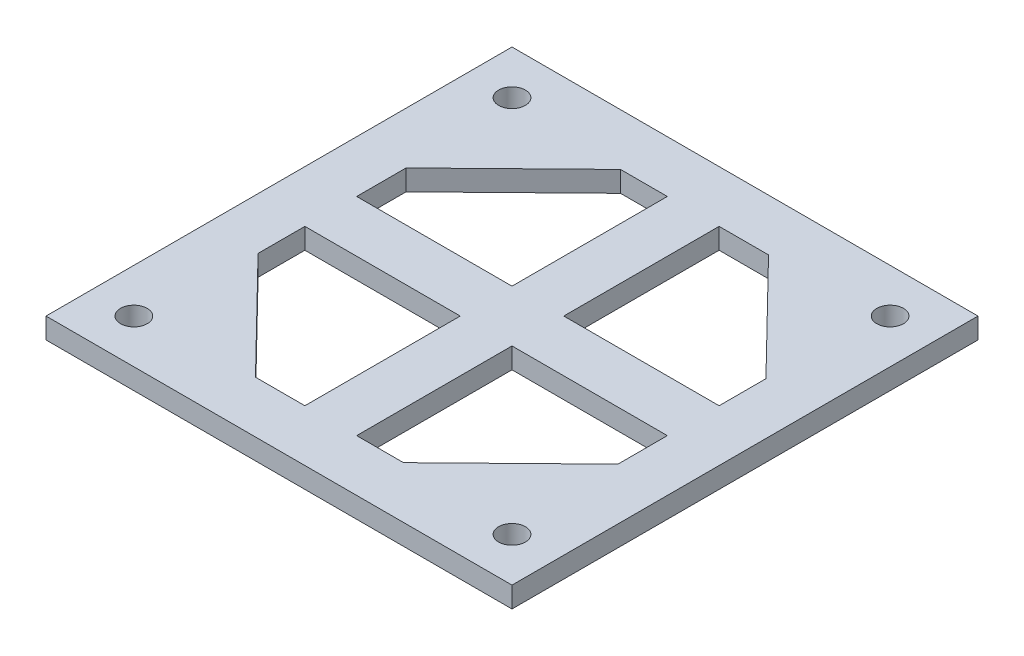
ISO-10303-21;
HEADER;
FILE_DESCRIPTION(('STEP AP214'),'2;1');
FILE_NAME('part.step','',(''),(''),'','','');
FILE_SCHEMA(('AUTOMOTIVE_DESIGN { 1 0 10303 214 1 1 1 1 }'));
ENDSEC;
DATA;
#1=APPLICATION_CONTEXT('core data for automotive mechanical design processes');
#2=APPLICATION_PROTOCOL_DEFINITION('international standard','automotive_design',2000,#1);
#3=PRODUCT_CONTEXT('',#1,'mechanical');
#4=PRODUCT('Part','Part','',(#3));
#5=PRODUCT_RELATED_PRODUCT_CATEGORY('part','',(#4));
#6=PRODUCT_DEFINITION_FORMATION('','',#4);
#7=PRODUCT_DEFINITION_CONTEXT('part definition',#1,'design');
#8=PRODUCT_DEFINITION('design','',#6,#7);
#9=PRODUCT_DEFINITION_SHAPE('','',#8);
#10=(LENGTH_UNIT() NAMED_UNIT(*) SI_UNIT(.MILLI.,.METRE.));
#11=(NAMED_UNIT(*) PLANE_ANGLE_UNIT() SI_UNIT($,.RADIAN.));
#12=(NAMED_UNIT(*) SI_UNIT($,.STERADIAN.) SOLID_ANGLE_UNIT());
#13=UNCERTAINTY_MEASURE_WITH_UNIT(LENGTH_MEASURE(1.E-05),#10,'distance_accuracy_value','');
#14=(GEOMETRIC_REPRESENTATION_CONTEXT(3) GLOBAL_UNCERTAINTY_ASSIGNED_CONTEXT((#13)) GLOBAL_UNIT_ASSIGNED_CONTEXT((#10,
#11,#12)) REPRESENTATION_CONTEXT('',''));
#15=CARTESIAN_POINT('',(0.,0.,0.));
#16=DIRECTION('',(0.,0.,1.));
#17=DIRECTION('',(1.,0.,0.));
#18=AXIS2_PLACEMENT_3D('',#15,#16,#17);
#19=CARTESIAN_POINT('',(22.5,2.,-22.5));
#20=DIRECTION('',(-1.,0.,0.));
#21=DIRECTION('',(0.,0.,1.));
#22=AXIS2_PLACEMENT_3D('',#19,#20,#21);
#23=PLANE('',#22);
#24=DIRECTION('',(0.,0.,-1.));
#25=VECTOR('',#24,1.);
#26=CARTESIAN_POINT('',(22.5,0.,-22.5));
#27=LINE('',#26,#25);
#28=CARTESIAN_POINT('',(22.5,0.,22.5));
#29=VERTEX_POINT('',#28);
#30=CARTESIAN_POINT('',(22.5,0.,-22.5));
#31=VERTEX_POINT('',#30);
#32=EDGE_CURVE('E367',#29,#31,#27,.T.);
#33=ORIENTED_EDGE('',*,*,#32,.T.);
#34=DIRECTION('',(0.,-1.,0.));
#35=VECTOR('',#34,1.);
#36=CARTESIAN_POINT('',(22.5,2.,-22.5));
#37=LINE('',#36,#35);
#38=CARTESIAN_POINT('',(22.5,2.,-22.5));
#39=VERTEX_POINT('',#38);
#40=EDGE_CURVE('E11',#39,#31,#37,.T.);
#41=ORIENTED_EDGE('',*,*,#40,.F.);
#42=DIRECTION('',(0.,0.,-1.));
#43=VECTOR('',#42,1.);
#44=CARTESIAN_POINT('',(22.5,2.,-22.5));
#45=LINE('',#44,#43);
#46=CARTESIAN_POINT('',(22.5,2.,22.5));
#47=VERTEX_POINT('',#46);
#48=EDGE_CURVE('E368',#47,#39,#45,.T.);
#49=ORIENTED_EDGE('',*,*,#48,.F.);
#50=DIRECTION('',(0.,-1.,0.));
#51=VECTOR('',#50,1.);
#52=CARTESIAN_POINT('',(22.5,2.,22.5));
#53=LINE('',#52,#51);
#54=EDGE_CURVE('E378',#47,#29,#53,.T.);
#55=ORIENTED_EDGE('',*,*,#54,.T.);
#56=EDGE_LOOP('',(#33,#41,#49,#55));
#57=FACE_BOUND('',#56,.T.);
#58=ADVANCED_FACE('F39',(#57),#23,.F.);
#59=CARTESIAN_POINT('',(-22.5,2.,-22.5));
#60=DIRECTION('',(0.,0.,1.));
#61=DIRECTION('',(1.,0.,0.));
#62=AXIS2_PLACEMENT_3D('',#59,#60,#61);
#63=PLANE('',#62);
#64=DIRECTION('',(-1.,0.,0.));
#65=VECTOR('',#64,1.);
#66=CARTESIAN_POINT('',(-22.5,0.,-22.5));
#67=LINE('',#66,#65);
#68=CARTESIAN_POINT('',(-22.5,0.,-22.5));
#69=VERTEX_POINT('',#68);
#70=EDGE_CURVE('E381',#31,#69,#67,.T.);
#71=ORIENTED_EDGE('',*,*,#70,.T.);
#72=DIRECTION('',(0.,-1.,0.));
#73=VECTOR('',#72,1.);
#74=CARTESIAN_POINT('',(-22.5,2.,-22.5));
#75=LINE('',#74,#73);
#76=CARTESIAN_POINT('',(-22.5,2.,-22.5));
#77=VERTEX_POINT('',#76);
#78=EDGE_CURVE('E46',#77,#69,#75,.T.);
#79=ORIENTED_EDGE('',*,*,#78,.F.);
#80=DIRECTION('',(-1.,0.,0.));
#81=VECTOR('',#80,1.);
#82=CARTESIAN_POINT('',(-22.5,2.,-22.5));
#83=LINE('',#82,#81);
#84=EDGE_CURVE('E371',#39,#77,#83,.T.);
#85=ORIENTED_EDGE('',*,*,#84,.F.);
#86=ORIENTED_EDGE('',*,*,#40,.T.);
#87=EDGE_LOOP('',(#71,#79,#85,#86));
#88=FACE_BOUND('',#87,.T.);
#89=ADVANCED_FACE('F410',(#88),#63,.F.);
#90=CARTESIAN_POINT('',(-22.5,2.,-22.5));
#91=DIRECTION('',(1.,0.,0.));
#92=DIRECTION('',(0.,0.,-1.));
#93=AXIS2_PLACEMENT_3D('',#90,#91,#92);
#94=PLANE('',#93);
#95=DIRECTION('',(0.,0.,1.));
#96=VECTOR('',#95,1.);
#97=CARTESIAN_POINT('',(-22.5,0.,-22.5));
#98=LINE('',#97,#96);
#99=CARTESIAN_POINT('',(-22.5,0.,22.5));
#100=VERTEX_POINT('',#99);
#101=EDGE_CURVE('E383',#69,#100,#98,.T.);
#102=ORIENTED_EDGE('',*,*,#101,.T.);
#103=DIRECTION('',(0.,-1.,0.));
#104=VECTOR('',#103,1.);
#105=CARTESIAN_POINT('',(-22.5,2.,22.5));
#106=LINE('',#105,#104);
#107=CARTESIAN_POINT('',(-22.5,2.,22.5));
#108=VERTEX_POINT('',#107);
#109=EDGE_CURVE('E388',#108,#100,#106,.T.);
#110=ORIENTED_EDGE('',*,*,#109,.F.);
#111=DIRECTION('',(0.,0.,1.));
#112=VECTOR('',#111,1.);
#113=CARTESIAN_POINT('',(-22.5,2.,-22.5));
#114=LINE('',#113,#112);
#115=EDGE_CURVE('E374',#77,#108,#114,.T.);
#116=ORIENTED_EDGE('',*,*,#115,.F.);
#117=ORIENTED_EDGE('',*,*,#78,.T.);
#118=EDGE_LOOP('',(#102,#110,#116,#117));
#119=FACE_BOUND('',#118,.T.);
#120=ADVANCED_FACE('F395',(#119),#94,.F.);
#121=CARTESIAN_POINT('',(-22.5,2.,22.5));
#122=DIRECTION('',(0.,0.,-1.));
#123=DIRECTION('',(-1.,0.,0.));
#124=AXIS2_PLACEMENT_3D('',#121,#122,#123);
#125=PLANE('',#124);
#126=DIRECTION('',(1.,0.,0.));
#127=VECTOR('',#126,1.);
#128=CARTESIAN_POINT('',(-22.5,0.,22.5));
#129=LINE('',#128,#127);
#130=EDGE_CURVE('E372',#100,#29,#129,.T.);
#131=ORIENTED_EDGE('',*,*,#130,.T.);
#132=ORIENTED_EDGE('',*,*,#54,.F.);
#133=DIRECTION('',(1.,0.,0.));
#134=VECTOR('',#133,1.);
#135=CARTESIAN_POINT('',(-22.5,2.,22.5));
#136=LINE('',#135,#134);
#137=EDGE_CURVE('E376',#108,#47,#136,.T.);
#138=ORIENTED_EDGE('',*,*,#137,.F.);
#139=ORIENTED_EDGE('',*,*,#109,.T.);
#140=EDGE_LOOP('',(#131,#132,#138,#139));
#141=FACE_BOUND('',#140,.T.);
#142=ADVANCED_FACE('F404',(#141),#125,.F.);
#143=CARTESIAN_POINT('',(0.,2.,0.));
#144=DIRECTION('',(0.,1.,0.));
#145=DIRECTION('',(0.,0.,1.));
#146=AXIS2_PLACEMENT_3D('',#143,#144,#145);
#147=PLANE('',#146);
#148=CARTESIAN_POINT('',(-18.2573593128807,2.,-18.2573593128807));
#149=DIRECTION('',(0.,1.,0.));
#150=DIRECTION('',(0.,0.,1.));
#151=AXIS2_PLACEMENT_3D('',#148,#149,#150);
#152=CIRCLE('',#151,1.28921475598744);
#153=CARTESIAN_POINT('',(-18.2573593128807,2.,-16.9681445568933));
#154=VERTEX_POINT('',#153);
#155=EDGE_CURVE('E520',#154,#154,#152,.F.);
#156=ORIENTED_EDGE('',*,*,#155,.T.);
#157=EDGE_LOOP('',(#156));
#158=FACE_BOUND('',#157,.T.);
#159=CARTESIAN_POINT('',(18.2573593128809,2.,-18.2573593128805));
#160=DIRECTION('',(0.,1.,0.));
#161=DIRECTION('',(0.,0.,1.));
#162=AXIS2_PLACEMENT_3D('',#159,#160,#161);
#163=CIRCLE('',#162,1.28921475598744);
#164=CARTESIAN_POINT('',(18.2573593128809,2.,-16.9681445568931));
#165=VERTEX_POINT('',#164);
#166=EDGE_CURVE('E533',#165,#165,#163,.F.);
#167=ORIENTED_EDGE('',*,*,#166,.T.);
#168=EDGE_LOOP('',(#167));
#169=FACE_BOUND('',#168,.T.);
#170=CARTESIAN_POINT('',(-18.2573593128808,2.,18.2573593128807));
#171=DIRECTION('',(0.,1.,0.));
#172=DIRECTION('',(0.,0.,1.));
#173=AXIS2_PLACEMENT_3D('',#170,#171,#172);
#174=CIRCLE('',#173,1.28921475598744);
#175=CARTESIAN_POINT('',(-18.2573593128808,2.,19.5465740688681));
#176=VERTEX_POINT('',#175);
#177=EDGE_CURVE('E524',#176,#176,#174,.F.);
#178=ORIENTED_EDGE('',*,*,#177,.T.);
#179=EDGE_LOOP('',(#178));
#180=FACE_BOUND('',#179,.T.);
#181=DIRECTION('',(0.,0.,1.));
#182=VECTOR('',#181,1.);
#183=CARTESIAN_POINT('',(-2.5,2.,-2.5));
#184=LINE('',#183,#182);
#185=CARTESIAN_POINT('',(-2.5,2.,-17.5));
#186=VERTEX_POINT('',#185);
#187=CARTESIAN_POINT('',(-2.5,2.,-2.5));
#188=VERTEX_POINT('',#187);
#189=EDGE_CURVE('E212',#186,#188,#184,.T.);
#190=ORIENTED_EDGE('',*,*,#189,.T.);
#191=DIRECTION('',(-1.,0.,0.));
#192=VECTOR('',#191,1.);
#193=CARTESIAN_POINT('',(-17.5,2.,-2.5));
#194=LINE('',#193,#192);
#195=CARTESIAN_POINT('',(-17.5,2.,-2.5));
#196=VERTEX_POINT('',#195);
#197=EDGE_CURVE('E199',#188,#196,#194,.T.);
#198=ORIENTED_EDGE('',*,*,#197,.T.);
#199=DIRECTION('',(0.,0.,-1.));
#200=VECTOR('',#199,1.);
#201=CARTESIAN_POINT('',(-17.5,2.,-7.27171556224812));
#202=LINE('',#201,#200);
#203=CARTESIAN_POINT('',(-17.5,2.,-7.27171556224812));
#204=VERTEX_POINT('',#203);
#205=EDGE_CURVE('E235',#196,#204,#202,.T.);
#206=ORIENTED_EDGE('',*,*,#205,.T.);
#207=DIRECTION('',(0.715587384960187,0.,-0.698523224013233));
#208=VECTOR('',#207,1.);
#209=CARTESIAN_POINT('',(-7.02184972263544,2.,-17.5));
#210=LINE('',#209,#208);
#211=CARTESIAN_POINT('',(-7.02184972263544,2.,-17.5));
#212=VERTEX_POINT('',#211);
#213=EDGE_CURVE('E232',#204,#212,#210,.T.);
#214=ORIENTED_EDGE('',*,*,#213,.T.);
#215=DIRECTION('',(1.,0.,0.));
#216=VECTOR('',#215,1.);
#217=CARTESIAN_POINT('',(-2.5,2.,-17.5));
#218=LINE('',#217,#216);
#219=EDGE_CURVE('E221',#212,#186,#218,.T.);
#220=ORIENTED_EDGE('',*,*,#219,.T.);
#221=EDGE_LOOP('',(#190,#198,#206,#214,#220));
#222=FACE_BOUND('',#221,.T.);
#223=DIRECTION('',(-1.,0.,0.));
#224=VECTOR('',#223,1.);
#225=CARTESIAN_POINT('',(2.50000000000002,2.,-2.49999999999997));
#226=LINE('',#225,#224);
#227=CARTESIAN_POINT('',(17.5,2.,-2.49999999999982));
#228=VERTEX_POINT('',#227);
#229=CARTESIAN_POINT('',(2.50000000000002,2.,-2.49999999999997));
#230=VERTEX_POINT('',#229);
#231=EDGE_CURVE('E245',#228,#230,#226,.T.);
#232=ORIENTED_EDGE('',*,*,#231,.T.);
#233=DIRECTION('',(0.,0.,-1.));
#234=VECTOR('',#233,1.);
#235=CARTESIAN_POINT('',(2.50000000000018,2.,-17.5));
#236=LINE('',#235,#234);
#237=CARTESIAN_POINT('',(2.50000000000018,2.,-17.5));
#238=VERTEX_POINT('',#237);
#239=EDGE_CURVE('E273',#230,#238,#236,.T.);
#240=ORIENTED_EDGE('',*,*,#239,.T.);
#241=DIRECTION('',(1.,0.,0.));
#242=VECTOR('',#241,1.);
#243=CARTESIAN_POINT('',(7.27171556224831,2.,-17.4999999999999));
#244=LINE('',#243,#242);
#245=CARTESIAN_POINT('',(7.27171556224831,2.,-17.4999999999999));
#246=VERTEX_POINT('',#245);
#247=EDGE_CURVE('E269',#238,#246,#244,.T.);
#248=ORIENTED_EDGE('',*,*,#247,.T.);
#249=DIRECTION('',(0.698523224013226,0.,0.715587384960194));
#250=VECTOR('',#249,1.);
#251=CARTESIAN_POINT('',(17.5000000000001,2.,-7.02184972263526));
#252=LINE('',#251,#250);
#253=CARTESIAN_POINT('',(17.5000000000001,2.,-7.02184972263526));
#254=VERTEX_POINT('',#253);
#255=EDGE_CURVE('E265',#246,#254,#252,.T.);
#256=ORIENTED_EDGE('',*,*,#255,.T.);
#257=DIRECTION('',(0.,0.,1.));
#258=VECTOR('',#257,1.);
#259=CARTESIAN_POINT('',(17.5,2.,-2.49999999999982));
#260=LINE('',#259,#258);
#261=EDGE_CURVE('E261',#254,#228,#260,.T.);
#262=ORIENTED_EDGE('',*,*,#261,.T.);
#263=EDGE_LOOP('',(#232,#240,#248,#256,#262));
#264=FACE_BOUND('',#263,.T.);
#265=DIRECTION('',(1.,0.,0.));
#266=VECTOR('',#265,1.);
#267=CARTESIAN_POINT('',(-2.50000000000001,2.,2.49999999999999));
#268=LINE('',#267,#266);
#269=CARTESIAN_POINT('',(-17.5,2.,2.49999999999994));
#270=VERTEX_POINT('',#269);
#271=CARTESIAN_POINT('',(-2.50000000000001,2.00000000000001,2.49999999999999));
#272=VERTEX_POINT('',#271);
#273=EDGE_CURVE('E284',#270,#272,#268,.T.);
#274=ORIENTED_EDGE('',*,*,#273,.T.);
#275=DIRECTION('',(0.,0.,1.));
#276=VECTOR('',#275,1.);
#277=CARTESIAN_POINT('',(-2.50000000000006,2.,17.5));
#278=LINE('',#277,#276);
#279=CARTESIAN_POINT('',(-2.50000000000006,2.,17.5));
#280=VERTEX_POINT('',#279);
#281=EDGE_CURVE('E312',#272,#280,#278,.T.);
#282=ORIENTED_EDGE('',*,*,#281,.T.);
#283=DIRECTION('',(-1.,0.,0.));
#284=VECTOR('',#283,1.);
#285=CARTESIAN_POINT('',(-7.27171556224818,2.,17.5));
#286=LINE('',#285,#284);
#287=CARTESIAN_POINT('',(-7.27171556224818,2.,17.5));
#288=VERTEX_POINT('',#287);
#289=EDGE_CURVE('E308',#280,#288,#286,.T.);
#290=ORIENTED_EDGE('',*,*,#289,.T.);
#291=DIRECTION('',(-0.698523224013231,0.,-0.715587384960189));
#292=VECTOR('',#291,1.);
#293=CARTESIAN_POINT('',(-17.5,2.,7.02184972263538));
#294=LINE('',#293,#292);
#295=CARTESIAN_POINT('',(-17.5,2.,7.02184972263538));
#296=VERTEX_POINT('',#295);
#297=EDGE_CURVE('E304',#288,#296,#294,.T.);
#298=ORIENTED_EDGE('',*,*,#297,.T.);
#299=DIRECTION('',(0.,0.,-1.));
#300=VECTOR('',#299,1.);
#301=CARTESIAN_POINT('',(-17.5,2.,2.49999999999994));
#302=LINE('',#301,#300);
#303=EDGE_CURVE('E299',#296,#270,#302,.T.);
#304=ORIENTED_EDGE('',*,*,#303,.T.);
#305=EDGE_LOOP('',(#274,#282,#290,#298,#304));
#306=FACE_BOUND('',#305,.T.);
#307=CARTESIAN_POINT('',(18.2573593128807,2.,18.2573593128807));
#308=DIRECTION('',(0.,1.,0.));
#309=DIRECTION('',(0.,0.,1.));
#310=AXIS2_PLACEMENT_3D('',#307,#308,#309);
#311=CIRCLE('',#310,1.28921475598744);
#312=CARTESIAN_POINT('',(18.2573593128807,2.,19.5465740688682));
#313=VERTEX_POINT('',#312);
#314=EDGE_CURVE('E321',#313,#313,#311,.F.);
#315=ORIENTED_EDGE('',*,*,#314,.T.);
#316=EDGE_LOOP('',(#315));
#317=FACE_BOUND('',#316,.T.);
#318=DIRECTION('',(0.,0.,-1.));
#319=VECTOR('',#318,1.);
#320=CARTESIAN_POINT('',(2.5,2.,2.5));
#321=LINE('',#320,#319);
#322=CARTESIAN_POINT('',(2.5,2.,17.5));
#323=VERTEX_POINT('',#322);
#324=CARTESIAN_POINT('',(2.5,2.,2.5));
#325=VERTEX_POINT('',#324);
#326=EDGE_CURVE('E330',#323,#325,#321,.T.);
#327=ORIENTED_EDGE('',*,*,#326,.T.);
#328=DIRECTION('',(1.,0.,0.));
#329=VECTOR('',#328,1.);
#330=CARTESIAN_POINT('',(17.5,2.,2.5));
#331=LINE('',#330,#329);
#332=CARTESIAN_POINT('',(17.5,2.,2.5));
#333=VERTEX_POINT('',#332);
#334=EDGE_CURVE('E358',#325,#333,#331,.T.);
#335=ORIENTED_EDGE('',*,*,#334,.T.);
#336=DIRECTION('',(0.,0.,1.));
#337=VECTOR('',#336,1.);
#338=CARTESIAN_POINT('',(17.5,2.,7.27171556224812));
#339=LINE('',#338,#337);
#340=CARTESIAN_POINT('',(17.5,2.,7.27171556224812));
#341=VERTEX_POINT('',#340);
#342=EDGE_CURVE('E354',#333,#341,#339,.T.);
#343=ORIENTED_EDGE('',*,*,#342,.T.);
#344=DIRECTION('',(-0.715587384960187,0.,0.698523224013233));
#345=VECTOR('',#344,1.);
#346=CARTESIAN_POINT('',(7.02184972263544,2.,17.5));
#347=LINE('',#346,#345);
#348=CARTESIAN_POINT('',(7.02184972263544,2.,17.5));
#349=VERTEX_POINT('',#348);
#350=EDGE_CURVE('E350',#341,#349,#347,.T.);
#351=ORIENTED_EDGE('',*,*,#350,.T.);
#352=DIRECTION('',(-1.,0.,0.));
#353=VECTOR('',#352,1.);
#354=CARTESIAN_POINT('',(2.5,2.,17.5));
#355=LINE('',#354,#353);
#356=EDGE_CURVE('E345',#349,#323,#355,.T.);
#357=ORIENTED_EDGE('',*,*,#356,.T.);
#358=EDGE_LOOP('',(#327,#335,#343,#351,#357));
#359=FACE_BOUND('',#358,.T.);
#360=ORIENTED_EDGE('',*,*,#48,.T.);
#361=ORIENTED_EDGE('',*,*,#84,.T.);
#362=ORIENTED_EDGE('',*,*,#115,.T.);
#363=ORIENTED_EDGE('',*,*,#137,.T.);
#364=EDGE_LOOP('',(#360,#361,#362,#363));
#365=FACE_BOUND('',#364,.T.);
#366=ADVANCED_FACE('F218',(#158,#169,#180,#222,#264,#306,#317,#359,#365),#147,.T.);
#367=CARTESIAN_POINT('',(0.,0.,0.));
#368=DIRECTION('',(0.,1.,0.));
#369=DIRECTION('',(0.,0.,1.));
#370=AXIS2_PLACEMENT_3D('',#367,#368,#369);
#371=PLANE('',#370);
#372=CARTESIAN_POINT('',(-18.2573593128807,0.,-18.2573593128807));
#373=DIRECTION('',(0.,-1.,0.));
#374=DIRECTION('',(0.,0.,1.));
#375=AXIS2_PLACEMENT_3D('',#372,#373,#374);
#376=CIRCLE('',#375,1.28921475598744);
#377=CARTESIAN_POINT('',(-18.2573593128807,0.,-16.9681445568933));
#378=VERTEX_POINT('',#377);
#379=EDGE_CURVE('E523',#378,#378,#376,.T.);
#380=ORIENTED_EDGE('',*,*,#379,.F.);
#381=EDGE_LOOP('',(#380));
#382=FACE_BOUND('',#381,.T.);
#383=CARTESIAN_POINT('',(18.2573593128809,0.,-18.2573593128805));
#384=DIRECTION('',(0.,-1.,0.));
#385=DIRECTION('',(-1.,0.,0.));
#386=AXIS2_PLACEMENT_3D('',#383,#384,#385);
#387=CIRCLE('',#386,1.28921475598744);
#388=CARTESIAN_POINT('',(16.9681445568935,0.,-18.2573593128805));
#389=VERTEX_POINT('',#388);
#390=EDGE_CURVE('E528',#389,#389,#387,.T.);
#391=ORIENTED_EDGE('',*,*,#390,.F.);
#392=EDGE_LOOP('',(#391));
#393=FACE_BOUND('',#392,.T.);
#394=CARTESIAN_POINT('',(-18.2573593128808,0.,18.2573593128807));
#395=DIRECTION('',(0.,-1.,0.));
#396=DIRECTION('',(1.,0.,0.));
#397=AXIS2_PLACEMENT_3D('',#394,#395,#396);
#398=CIRCLE('',#397,1.28921475598744);
#399=CARTESIAN_POINT('',(-16.9681445568933,0.,18.2573593128807));
#400=VERTEX_POINT('',#399);
#401=EDGE_CURVE('E257',#400,#400,#398,.T.);
#402=ORIENTED_EDGE('',*,*,#401,.F.);
#403=EDGE_LOOP('',(#402));
#404=FACE_BOUND('',#403,.T.);
#405=DIRECTION('',(-1.,0.,0.));
#406=VECTOR('',#405,1.);
#407=CARTESIAN_POINT('',(-17.5,0.,-2.5));
#408=LINE('',#407,#406);
#409=CARTESIAN_POINT('',(-2.5,0.,-2.5));
#410=VERTEX_POINT('',#409);
#411=CARTESIAN_POINT('',(-17.5,0.,-2.5));
#412=VERTEX_POINT('',#411);
#413=EDGE_CURVE('E540',#410,#412,#408,.T.);
#414=ORIENTED_EDGE('',*,*,#413,.F.);
#415=DIRECTION('',(0.,0.,1.));
#416=VECTOR('',#415,1.);
#417=CARTESIAN_POINT('',(-2.5,0.,-2.5));
#418=LINE('',#417,#416);
#419=CARTESIAN_POINT('',(-2.5,0.,-17.5));
#420=VERTEX_POINT('',#419);
#421=EDGE_CURVE('E215',#420,#410,#418,.T.);
#422=ORIENTED_EDGE('',*,*,#421,.F.);
#423=DIRECTION('',(1.,0.,0.));
#424=VECTOR('',#423,1.);
#425=CARTESIAN_POINT('',(-2.5,0.,-17.5));
#426=LINE('',#425,#424);
#427=CARTESIAN_POINT('',(-7.02184972263544,0.,-17.5));
#428=VERTEX_POINT('',#427);
#429=EDGE_CURVE('E228',#428,#420,#426,.T.);
#430=ORIENTED_EDGE('',*,*,#429,.F.);
#431=DIRECTION('',(0.715587384960187,0.,-0.698523224013233));
#432=VECTOR('',#431,1.);
#433=CARTESIAN_POINT('',(-7.02184972263544,0.,-17.5));
#434=LINE('',#433,#432);
#435=CARTESIAN_POINT('',(-17.5,0.,-7.27171556224812));
#436=VERTEX_POINT('',#435);
#437=EDGE_CURVE('E222',#436,#428,#434,.T.);
#438=ORIENTED_EDGE('',*,*,#437,.F.);
#439=DIRECTION('',(0.,0.,-1.));
#440=VECTOR('',#439,1.);
#441=CARTESIAN_POINT('',(-17.5,0.,-7.27171556224812));
#442=LINE('',#441,#440);
#443=EDGE_CURVE('E224',#412,#436,#442,.T.);
#444=ORIENTED_EDGE('',*,*,#443,.F.);
#445=EDGE_LOOP('',(#414,#422,#430,#438,#444));
#446=FACE_BOUND('',#445,.T.);
#447=DIRECTION('',(0.,0.,-1.));
#448=VECTOR('',#447,1.);
#449=CARTESIAN_POINT('',(2.50000000000018,0.,-17.5));
#450=LINE('',#449,#448);
#451=CARTESIAN_POINT('',(2.50000000000002,0.,-2.49999999999997));
#452=VERTEX_POINT('',#451);
#453=CARTESIAN_POINT('',(2.50000000000018,0.,-17.5));
#454=VERTEX_POINT('',#453);
#455=EDGE_CURVE('E249',#452,#454,#450,.T.);
#456=ORIENTED_EDGE('',*,*,#455,.F.);
#457=DIRECTION('',(-1.,0.,0.));
#458=VECTOR('',#457,1.);
#459=CARTESIAN_POINT('',(2.50000000000002,0.,-2.49999999999997));
#460=LINE('',#459,#458);
#461=CARTESIAN_POINT('',(17.5,0.,-2.49999999999982));
#462=VERTEX_POINT('',#461);
#463=EDGE_CURVE('E252',#462,#452,#460,.T.);
#464=ORIENTED_EDGE('',*,*,#463,.F.);
#465=DIRECTION('',(0.,0.,1.));
#466=VECTOR('',#465,1.);
#467=CARTESIAN_POINT('',(17.5,0.,-2.49999999999982));
#468=LINE('',#467,#466);
#469=CARTESIAN_POINT('',(17.5000000000001,0.,-7.02184972263526));
#470=VERTEX_POINT('',#469);
#471=EDGE_CURVE('E255',#470,#462,#468,.T.);
#472=ORIENTED_EDGE('',*,*,#471,.F.);
#473=DIRECTION('',(0.698523224013226,0.,0.715587384960194));
#474=VECTOR('',#473,1.);
#475=CARTESIAN_POINT('',(17.5000000000001,0.,-7.02184972263526));
#476=LINE('',#475,#474);
#477=CARTESIAN_POINT('',(7.27171556224831,0.,-17.4999999999999));
#478=VERTEX_POINT('',#477);
#479=EDGE_CURVE('E243',#478,#470,#476,.T.);
#480=ORIENTED_EDGE('',*,*,#479,.F.);
#481=DIRECTION('',(1.,0.,0.));
#482=VECTOR('',#481,1.);
#483=CARTESIAN_POINT('',(7.27171556224831,0.,-17.4999999999999));
#484=LINE('',#483,#482);
#485=EDGE_CURVE('E246',#454,#478,#484,.T.);
#486=ORIENTED_EDGE('',*,*,#485,.F.);
#487=EDGE_LOOP('',(#456,#464,#472,#480,#486));
#488=FACE_BOUND('',#487,.T.);
#489=DIRECTION('',(0.,0.,1.));
#490=VECTOR('',#489,1.);
#491=CARTESIAN_POINT('',(-2.50000000000006,0.,17.5));
#492=LINE('',#491,#490);
#493=CARTESIAN_POINT('',(-2.50000000000001,0.,2.49999999999999));
#494=VERTEX_POINT('',#493);
#495=CARTESIAN_POINT('',(-2.50000000000006,0.,17.5));
#496=VERTEX_POINT('',#495);
#497=EDGE_CURVE('E288',#494,#496,#492,.T.);
#498=ORIENTED_EDGE('',*,*,#497,.F.);
#499=DIRECTION('',(1.,0.,0.));
#500=VECTOR('',#499,1.);
#501=CARTESIAN_POINT('',(-2.50000000000001,0.,2.49999999999999));
#502=LINE('',#501,#500);
#503=CARTESIAN_POINT('',(-17.5,0.,2.49999999999994));
#504=VERTEX_POINT('',#503);
#505=EDGE_CURVE('E291',#504,#494,#502,.T.);
#506=ORIENTED_EDGE('',*,*,#505,.F.);
#507=DIRECTION('',(0.,0.,-1.));
#508=VECTOR('',#507,1.);
#509=CARTESIAN_POINT('',(-17.5,0.,2.49999999999994));
#510=LINE('',#509,#508);
#511=CARTESIAN_POINT('',(-17.5,0.,7.02184972263538));
#512=VERTEX_POINT('',#511);
#513=EDGE_CURVE('E242',#512,#504,#510,.T.);
#514=ORIENTED_EDGE('',*,*,#513,.F.);
#515=DIRECTION('',(-0.698523224013231,0.,-0.715587384960189));
#516=VECTOR('',#515,1.);
#517=CARTESIAN_POINT('',(-17.5,0.,7.02184972263538));
#518=LINE('',#517,#516);
#519=CARTESIAN_POINT('',(-7.27171556224818,0.,17.5));
#520=VERTEX_POINT('',#519);
#521=EDGE_CURVE('E282',#520,#512,#518,.T.);
#522=ORIENTED_EDGE('',*,*,#521,.F.);
#523=DIRECTION('',(-1.,0.,0.));
#524=VECTOR('',#523,1.);
#525=CARTESIAN_POINT('',(-7.27171556224818,0.,17.5));
#526=LINE('',#525,#524);
#527=EDGE_CURVE('E285',#496,#520,#526,.T.);
#528=ORIENTED_EDGE('',*,*,#527,.F.);
#529=EDGE_LOOP('',(#498,#506,#514,#522,#528));
#530=FACE_BOUND('',#529,.T.);
#531=CARTESIAN_POINT('',(18.2573593128807,0.,18.2573593128807));
#532=DIRECTION('',(0.,-1.,0.));
#533=DIRECTION('',(0.,0.,-1.));
#534=AXIS2_PLACEMENT_3D('',#531,#532,#533);
#535=CIRCLE('',#534,1.28921475598744);
#536=CARTESIAN_POINT('',(18.2573593128807,0.,16.9681445568933));
#537=VERTEX_POINT('',#536);
#538=EDGE_CURVE('E322',#537,#537,#535,.T.);
#539=ORIENTED_EDGE('',*,*,#538,.F.);
#540=EDGE_LOOP('',(#539));
#541=FACE_BOUND('',#540,.T.);
#542=DIRECTION('',(1.,0.,0.));
#543=VECTOR('',#542,1.);
#544=CARTESIAN_POINT('',(17.5,0.,2.5));
#545=LINE('',#544,#543);
#546=CARTESIAN_POINT('',(2.5,0.,2.5));
#547=VERTEX_POINT('',#546);
#548=CARTESIAN_POINT('',(17.5,0.,2.5));
#549=VERTEX_POINT('',#548);
#550=EDGE_CURVE('E334',#547,#549,#545,.T.);
#551=ORIENTED_EDGE('',*,*,#550,.F.);
#552=DIRECTION('',(0.,0.,-1.));
#553=VECTOR('',#552,1.);
#554=CARTESIAN_POINT('',(2.5,0.,2.5));
#555=LINE('',#554,#553);
#556=CARTESIAN_POINT('',(2.5,0.,17.5));
#557=VERTEX_POINT('',#556);
#558=EDGE_CURVE('E337',#557,#547,#555,.T.);
#559=ORIENTED_EDGE('',*,*,#558,.F.);
#560=DIRECTION('',(-1.,0.,0.));
#561=VECTOR('',#560,1.);
#562=CARTESIAN_POINT('',(2.5,0.,17.5));
#563=LINE('',#562,#561);
#564=CARTESIAN_POINT('',(7.02184972263544,0.,17.5));
#565=VERTEX_POINT('',#564);
#566=EDGE_CURVE('E325',#565,#557,#563,.T.);
#567=ORIENTED_EDGE('',*,*,#566,.F.);
#568=DIRECTION('',(-0.715587384960187,0.,0.698523224013233));
#569=VECTOR('',#568,1.);
#570=CARTESIAN_POINT('',(7.02184972263544,0.,17.5));
#571=LINE('',#570,#569);
#572=CARTESIAN_POINT('',(17.5,0.,7.27171556224812));
#573=VERTEX_POINT('',#572);
#574=EDGE_CURVE('E328',#573,#565,#571,.T.);
#575=ORIENTED_EDGE('',*,*,#574,.F.);
#576=DIRECTION('',(0.,0.,1.));
#577=VECTOR('',#576,1.);
#578=CARTESIAN_POINT('',(17.5,0.,7.27171556224812));
#579=LINE('',#578,#577);
#580=EDGE_CURVE('E331',#549,#573,#579,.T.);
#581=ORIENTED_EDGE('',*,*,#580,.F.);
#582=EDGE_LOOP('',(#551,#559,#567,#575,#581));
#583=FACE_BOUND('',#582,.T.);
#584=ORIENTED_EDGE('',*,*,#32,.F.);
#585=ORIENTED_EDGE('',*,*,#130,.F.);
#586=ORIENTED_EDGE('',*,*,#101,.F.);
#587=ORIENTED_EDGE('',*,*,#70,.F.);
#588=EDGE_LOOP('',(#584,#585,#586,#587));
#589=FACE_BOUND('',#588,.T.);
#590=ADVANCED_FACE('F401',(#382,#393,#404,#446,#488,#530,#541,#583,#589),#371,.F.);
#591=CARTESIAN_POINT('',(2.5,23.2132034355964,2.5));
#592=DIRECTION('',(-1.,0.,0.));
#593=DIRECTION('',(0.,0.,1.));
#594=AXIS2_PLACEMENT_3D('',#591,#592,#593);
#595=PLANE('',#594);
#596=DIRECTION('',(0.,-1.,0.));
#597=VECTOR('',#596,1.);
#598=CARTESIAN_POINT('',(2.5,23.2132034355964,17.5));
#599=LINE('',#598,#597);
#600=EDGE_CURVE('E348',#323,#557,#599,.T.);
#601=ORIENTED_EDGE('',*,*,#600,.T.);
#602=ORIENTED_EDGE('',*,*,#558,.T.);
#603=DIRECTION('',(0.,-1.,0.));
#604=VECTOR('',#603,1.);
#605=CARTESIAN_POINT('',(2.5,23.2132034355964,2.5));
#606=LINE('',#605,#604);
#607=EDGE_CURVE('E344',#325,#547,#606,.T.);
#608=ORIENTED_EDGE('',*,*,#607,.F.);
#609=ORIENTED_EDGE('',*,*,#326,.F.);
#610=EDGE_LOOP('',(#601,#602,#608,#609));
#611=FACE_BOUND('',#610,.T.);
#612=ADVANCED_FACE('F422',(#611),#595,.F.);
#613=CARTESIAN_POINT('',(17.5,23.2132034355964,2.5));
#614=DIRECTION('',(0.,0.,-1.));
#615=DIRECTION('',(-1.,0.,0.));
#616=AXIS2_PLACEMENT_3D('',#613,#614,#615);
#617=PLANE('',#616);
#618=ORIENTED_EDGE('',*,*,#607,.T.);
#619=ORIENTED_EDGE('',*,*,#550,.T.);
#620=DIRECTION('',(0.,-1.,0.));
#621=VECTOR('',#620,1.);
#622=CARTESIAN_POINT('',(17.5,23.2132034355964,2.5));
#623=LINE('',#622,#621);
#624=EDGE_CURVE('E357',#333,#549,#623,.T.);
#625=ORIENTED_EDGE('',*,*,#624,.F.);
#626=ORIENTED_EDGE('',*,*,#334,.F.);
#627=EDGE_LOOP('',(#618,#619,#625,#626));
#628=FACE_BOUND('',#627,.T.);
#629=ADVANCED_FACE('F429',(#628),#617,.F.);
#630=CARTESIAN_POINT('',(17.5,23.2132034355964,7.27171556224812));
#631=DIRECTION('',(1.,0.,0.));
#632=DIRECTION('',(0.,0.,-1.));
#633=AXIS2_PLACEMENT_3D('',#630,#631,#632);
#634=PLANE('',#633);
#635=ORIENTED_EDGE('',*,*,#624,.T.);
#636=ORIENTED_EDGE('',*,*,#580,.T.);
#637=DIRECTION('',(0.,-1.,0.));
#638=VECTOR('',#637,1.);
#639=CARTESIAN_POINT('',(17.5,23.2132034355964,7.27171556224812));
#640=LINE('',#639,#638);
#641=EDGE_CURVE('E353',#341,#573,#640,.T.);
#642=ORIENTED_EDGE('',*,*,#641,.F.);
#643=ORIENTED_EDGE('',*,*,#342,.F.);
#644=EDGE_LOOP('',(#635,#636,#642,#643));
#645=FACE_BOUND('',#644,.T.);
#646=ADVANCED_FACE('F433',(#645),#634,.F.);
#647=CARTESIAN_POINT('',(7.02184972263544,23.2132034355964,17.5));
#648=DIRECTION('',(0.698523224013233,0.,0.715587384960187));
#649=DIRECTION('',(0.715587384960187,0.,-0.698523224013233));
#650=AXIS2_PLACEMENT_3D('',#647,#648,#649);
#651=PLANE('',#650);
#652=ORIENTED_EDGE('',*,*,#641,.T.);
#653=ORIENTED_EDGE('',*,*,#574,.T.);
#654=DIRECTION('',(0.,-1.,0.));
#655=VECTOR('',#654,1.);
#656=CARTESIAN_POINT('',(7.02184972263544,23.2132034355964,17.5));
#657=LINE('',#656,#655);
#658=EDGE_CURVE('E349',#349,#565,#657,.T.);
#659=ORIENTED_EDGE('',*,*,#658,.F.);
#660=ORIENTED_EDGE('',*,*,#350,.F.);
#661=EDGE_LOOP('',(#652,#653,#659,#660));
#662=FACE_BOUND('',#661,.T.);
#663=ADVANCED_FACE('F437',(#662),#651,.F.);
#664=CARTESIAN_POINT('',(2.5,23.2132034355964,17.5));
#665=DIRECTION('',(0.,0.,1.));
#666=DIRECTION('',(1.,0.,0.));
#667=AXIS2_PLACEMENT_3D('',#664,#665,#666);
#668=PLANE('',#667);
#669=ORIENTED_EDGE('',*,*,#658,.T.);
#670=ORIENTED_EDGE('',*,*,#566,.T.);
#671=ORIENTED_EDGE('',*,*,#600,.F.);
#672=ORIENTED_EDGE('',*,*,#356,.F.);
#673=EDGE_LOOP('',(#669,#670,#671,#672));
#674=FACE_BOUND('',#673,.T.);
#675=ADVANCED_FACE('F441',(#674),#668,.F.);
#676=CARTESIAN_POINT('',(18.2573593128807,2.001,18.2573593128807));
#677=DIRECTION('',(0.,-1.,0.));
#678=DIRECTION('',(0.,0.,-1.));
#679=AXIS2_PLACEMENT_3D('',#676,#677,#678);
#680=CYLINDRICAL_SURFACE('',#679,1.28921475598744);
#681=ORIENTED_EDGE('',*,*,#314,.F.);
#682=EDGE_LOOP('',(#681));
#683=FACE_BOUND('',#682,.T.);
#684=ORIENTED_EDGE('',*,*,#538,.T.);
#685=EDGE_LOOP('',(#684));
#686=FACE_BOUND('',#685,.T.);
#687=ADVANCED_FACE('F445',(#683,#686),#680,.F.);
#688=CARTESIAN_POINT('',(-2.50000000000001,23.2132034355965,2.49999999999999));
#689=DIRECTION('',(0.,0.,-1.));
#690=DIRECTION('',(-1.,0.,0.));
#691=AXIS2_PLACEMENT_3D('',#688,#689,#690);
#692=PLANE('',#691);
#693=DIRECTION('',(0.,-1.,0.));
#694=VECTOR('',#693,1.);
#695=CARTESIAN_POINT('',(-17.5,23.2132034355965,2.49999999999994));
#696=LINE('',#695,#694);
#697=EDGE_CURVE('E302',#270,#504,#696,.T.);
#698=ORIENTED_EDGE('',*,*,#697,.T.);
#699=ORIENTED_EDGE('',*,*,#505,.T.);
#700=DIRECTION('',(0.,-1.,0.));
#701=VECTOR('',#700,1.);
#702=CARTESIAN_POINT('',(-2.50000000000001,23.2132034355965,2.49999999999999));
#703=LINE('',#702,#701);
#704=EDGE_CURVE('E298',#272,#494,#703,.T.);
#705=ORIENTED_EDGE('',*,*,#704,.F.);
#706=ORIENTED_EDGE('',*,*,#273,.F.);
#707=EDGE_LOOP('',(#698,#699,#705,#706));
#708=FACE_BOUND('',#707,.T.);
#709=ADVANCED_FACE('F449',(#708),#692,.F.);
#710=CARTESIAN_POINT('',(-2.50000000000006,23.2132034355965,17.5));
#711=DIRECTION('',(1.,0.,0.));
#712=DIRECTION('',(0.,0.,-1.));
#713=AXIS2_PLACEMENT_3D('',#710,#711,#712);
#714=PLANE('',#713);
#715=ORIENTED_EDGE('',*,*,#704,.T.);
#716=ORIENTED_EDGE('',*,*,#497,.T.);
#717=DIRECTION('',(0.,-1.,0.));
#718=VECTOR('',#717,1.);
#719=CARTESIAN_POINT('',(-2.50000000000006,23.2132034355965,17.5));
#720=LINE('',#719,#718);
#721=EDGE_CURVE('E311',#280,#496,#720,.T.);
#722=ORIENTED_EDGE('',*,*,#721,.F.);
#723=ORIENTED_EDGE('',*,*,#281,.F.);
#724=EDGE_LOOP('',(#715,#716,#722,#723));
#725=FACE_BOUND('',#724,.T.);
#726=ADVANCED_FACE('F453',(#725),#714,.F.);
#727=CARTESIAN_POINT('',(-7.27171556224818,23.2132034355965,17.5));
#728=DIRECTION('',(0.,0.,1.));
#729=DIRECTION('',(1.,0.,0.));
#730=AXIS2_PLACEMENT_3D('',#727,#728,#729);
#731=PLANE('',#730);
#732=ORIENTED_EDGE('',*,*,#721,.T.);
#733=ORIENTED_EDGE('',*,*,#527,.T.);
#734=DIRECTION('',(0.,-1.,0.));
#735=VECTOR('',#734,1.);
#736=CARTESIAN_POINT('',(-7.27171556224818,23.2132034355965,17.5));
#737=LINE('',#736,#735);
#738=EDGE_CURVE('E307',#288,#520,#737,.T.);
#739=ORIENTED_EDGE('',*,*,#738,.F.);
#740=ORIENTED_EDGE('',*,*,#289,.F.);
#741=EDGE_LOOP('',(#732,#733,#739,#740));
#742=FACE_BOUND('',#741,.T.);
#743=ADVANCED_FACE('F457',(#742),#731,.F.);
#744=CARTESIAN_POINT('',(-17.5,23.2132034355965,7.02184972263538));
#745=DIRECTION('',(-0.715587384960189,0.,0.698523224013231));
#746=DIRECTION('',(0.698523224013231,0.,0.715587384960189));
#747=AXIS2_PLACEMENT_3D('',#744,#745,#746);
#748=PLANE('',#747);
#749=ORIENTED_EDGE('',*,*,#738,.T.);
#750=ORIENTED_EDGE('',*,*,#521,.T.);
#751=DIRECTION('',(0.,-1.,0.));
#752=VECTOR('',#751,1.);
#753=CARTESIAN_POINT('',(-17.5,23.2132034355965,7.02184972263538));
#754=LINE('',#753,#752);
#755=EDGE_CURVE('E303',#296,#512,#754,.T.);
#756=ORIENTED_EDGE('',*,*,#755,.F.);
#757=ORIENTED_EDGE('',*,*,#297,.F.);
#758=EDGE_LOOP('',(#749,#750,#756,#757));
#759=FACE_BOUND('',#758,.T.);
#760=ADVANCED_FACE('F461',(#759),#748,.F.);
#761=CARTESIAN_POINT('',(-17.5,23.2132034355965,2.49999999999994));
#762=DIRECTION('',(-1.,0.,0.));
#763=DIRECTION('',(0.,0.,1.));
#764=AXIS2_PLACEMENT_3D('',#761,#762,#763);
#765=PLANE('',#764);
#766=ORIENTED_EDGE('',*,*,#755,.T.);
#767=ORIENTED_EDGE('',*,*,#513,.T.);
#768=ORIENTED_EDGE('',*,*,#697,.F.);
#769=ORIENTED_EDGE('',*,*,#303,.F.);
#770=EDGE_LOOP('',(#766,#767,#768,#769));
#771=FACE_BOUND('',#770,.T.);
#772=ADVANCED_FACE('F465',(#771),#765,.F.);
#773=CARTESIAN_POINT('',(2.50000000000002,23.2132034355966,-2.49999999999997));
#774=DIRECTION('',(0.,0.,1.));
#775=DIRECTION('',(1.,0.,0.));
#776=AXIS2_PLACEMENT_3D('',#773,#774,#775);
#777=PLANE('',#776);
#778=DIRECTION('',(0.,-1.,0.));
#779=VECTOR('',#778,1.);
#780=CARTESIAN_POINT('',(17.5,23.2132034355966,-2.49999999999982));
#781=LINE('',#780,#779);
#782=EDGE_CURVE('E61',#228,#462,#781,.T.);
#783=ORIENTED_EDGE('',*,*,#782,.T.);
#784=ORIENTED_EDGE('',*,*,#463,.T.);
#785=DIRECTION('',(0.,-1.,0.));
#786=VECTOR('',#785,1.);
#787=CARTESIAN_POINT('',(2.50000000000002,23.2132034355966,-2.49999999999997));
#788=LINE('',#787,#786);
#789=EDGE_CURVE('E260',#230,#452,#788,.T.);
#790=ORIENTED_EDGE('',*,*,#789,.F.);
#791=ORIENTED_EDGE('',*,*,#231,.F.);
#792=EDGE_LOOP('',(#783,#784,#790,#791));
#793=FACE_BOUND('',#792,.T.);
#794=ADVANCED_FACE('F469',(#793),#777,.F.);
#795=CARTESIAN_POINT('',(2.50000000000018,23.2132034355966,-17.5));
#796=DIRECTION('',(-1.,0.,0.));
#797=DIRECTION('',(0.,0.,1.));
#798=AXIS2_PLACEMENT_3D('',#795,#796,#797);
#799=PLANE('',#798);
#800=ORIENTED_EDGE('',*,*,#789,.T.);
#801=ORIENTED_EDGE('',*,*,#455,.T.);
#802=DIRECTION('',(0.,-1.,0.));
#803=VECTOR('',#802,1.);
#804=CARTESIAN_POINT('',(2.50000000000018,23.2132034355966,-17.5));
#805=LINE('',#804,#803);
#806=EDGE_CURVE('E272',#238,#454,#805,.T.);
#807=ORIENTED_EDGE('',*,*,#806,.F.);
#808=ORIENTED_EDGE('',*,*,#239,.F.);
#809=EDGE_LOOP('',(#800,#801,#807,#808));
#810=FACE_BOUND('',#809,.T.);
#811=ADVANCED_FACE('F473',(#810),#799,.F.);
#812=CARTESIAN_POINT('',(7.27171556224831,23.2132034355966,-17.4999999999999));
#813=DIRECTION('',(0.,0.,-1.));
#814=DIRECTION('',(-1.,0.,0.));
#815=AXIS2_PLACEMENT_3D('',#812,#813,#814);
#816=PLANE('',#815);
#817=ORIENTED_EDGE('',*,*,#806,.T.);
#818=ORIENTED_EDGE('',*,*,#485,.T.);
#819=DIRECTION('',(0.,-1.,0.));
#820=VECTOR('',#819,1.);
#821=CARTESIAN_POINT('',(7.27171556224831,23.2132034355966,-17.4999999999999));
#822=LINE('',#821,#820);
#823=EDGE_CURVE('E268',#246,#478,#822,.T.);
#824=ORIENTED_EDGE('',*,*,#823,.F.);
#825=ORIENTED_EDGE('',*,*,#247,.F.);
#826=EDGE_LOOP('',(#817,#818,#824,#825));
#827=FACE_BOUND('',#826,.T.);
#828=ADVANCED_FACE('F477',(#827),#816,.F.);
#829=CARTESIAN_POINT('',(17.5000000000001,23.2132034355966,-7.02184972263526));
#830=DIRECTION('',(0.715587384960194,0.,-0.698523224013226));
#831=DIRECTION('',(-0.698523224013226,0.,-0.715587384960194));
#832=AXIS2_PLACEMENT_3D('',#829,#830,#831);
#833=PLANE('',#832);
#834=ORIENTED_EDGE('',*,*,#823,.T.);
#835=ORIENTED_EDGE('',*,*,#479,.T.);
#836=DIRECTION('',(0.,-1.,0.));
#837=VECTOR('',#836,1.);
#838=CARTESIAN_POINT('',(17.5000000000001,23.2132034355966,-7.02184972263526));
#839=LINE('',#838,#837);
#840=EDGE_CURVE('E264',#254,#470,#839,.T.);
#841=ORIENTED_EDGE('',*,*,#840,.F.);
#842=ORIENTED_EDGE('',*,*,#255,.F.);
#843=EDGE_LOOP('',(#834,#835,#841,#842));
#844=FACE_BOUND('',#843,.T.);
#845=ADVANCED_FACE('F481',(#844),#833,.F.);
#846=CARTESIAN_POINT('',(17.5,23.2132034355966,-2.49999999999982));
#847=DIRECTION('',(1.,0.,0.));
#848=DIRECTION('',(0.,0.,-1.));
#849=AXIS2_PLACEMENT_3D('',#846,#847,#848);
#850=PLANE('',#849);
#851=ORIENTED_EDGE('',*,*,#840,.T.);
#852=ORIENTED_EDGE('',*,*,#471,.T.);
#853=ORIENTED_EDGE('',*,*,#782,.F.);
#854=ORIENTED_EDGE('',*,*,#261,.F.);
#855=EDGE_LOOP('',(#851,#852,#853,#854));
#856=FACE_BOUND('',#855,.T.);
#857=ADVANCED_FACE('F485',(#856),#850,.F.);
#858=CARTESIAN_POINT('',(-2.5,23.2132034355964,-2.5));
#859=DIRECTION('',(1.,0.,0.));
#860=DIRECTION('',(0.,0.,-1.));
#861=AXIS2_PLACEMENT_3D('',#858,#859,#860);
#862=PLANE('',#861);
#863=DIRECTION('',(0.,-1.,0.));
#864=VECTOR('',#863,1.);
#865=CARTESIAN_POINT('',(-2.5,23.2132034355964,-17.5));
#866=LINE('',#865,#864);
#867=EDGE_CURVE('E53',#186,#420,#866,.T.);
#868=ORIENTED_EDGE('',*,*,#867,.T.);
#869=ORIENTED_EDGE('',*,*,#421,.T.);
#870=DIRECTION('',(0.,-1.,0.));
#871=VECTOR('',#870,1.);
#872=CARTESIAN_POINT('',(-2.5,23.2132034355964,-2.5));
#873=LINE('',#872,#871);
#874=EDGE_CURVE('E203',#188,#410,#873,.T.);
#875=ORIENTED_EDGE('',*,*,#874,.F.);
#876=ORIENTED_EDGE('',*,*,#189,.F.);
#877=EDGE_LOOP('',(#868,#869,#875,#876));
#878=FACE_BOUND('',#877,.T.);
#879=ADVANCED_FACE('F211',(#878),#862,.F.);
#880=CARTESIAN_POINT('',(-17.5,23.2132034355964,-2.5));
#881=DIRECTION('',(0.,0.,1.));
#882=DIRECTION('',(1.,0.,0.));
#883=AXIS2_PLACEMENT_3D('',#880,#881,#882);
#884=PLANE('',#883);
#885=ORIENTED_EDGE('',*,*,#874,.T.);
#886=ORIENTED_EDGE('',*,*,#413,.T.);
#887=DIRECTION('',(0.,-1.,0.));
#888=VECTOR('',#887,1.);
#889=CARTESIAN_POINT('',(-17.5,23.2132034355964,-2.5));
#890=LINE('',#889,#888);
#891=EDGE_CURVE('E205',#196,#412,#890,.T.);
#892=ORIENTED_EDGE('',*,*,#891,.F.);
#893=ORIENTED_EDGE('',*,*,#197,.F.);
#894=EDGE_LOOP('',(#885,#886,#892,#893));
#895=FACE_BOUND('',#894,.T.);
#896=ADVANCED_FACE('F201',(#895),#884,.F.);
#897=CARTESIAN_POINT('',(-17.5,23.2132034355964,-7.27171556224812));
#898=DIRECTION('',(-1.,0.,0.));
#899=DIRECTION('',(0.,0.,1.));
#900=AXIS2_PLACEMENT_3D('',#897,#898,#899);
#901=PLANE('',#900);
#902=ORIENTED_EDGE('',*,*,#891,.T.);
#903=ORIENTED_EDGE('',*,*,#443,.T.);
#904=DIRECTION('',(0.,-1.,0.));
#905=VECTOR('',#904,1.);
#906=CARTESIAN_POINT('',(-17.5,23.2132034355964,-7.27171556224812));
#907=LINE('',#906,#905);
#908=EDGE_CURVE('E234',#204,#436,#907,.T.);
#909=ORIENTED_EDGE('',*,*,#908,.F.);
#910=ORIENTED_EDGE('',*,*,#205,.F.);
#911=EDGE_LOOP('',(#902,#903,#909,#910));
#912=FACE_BOUND('',#911,.T.);
#913=ADVANCED_FACE('F493',(#912),#901,.F.);
#914=CARTESIAN_POINT('',(-7.02184972263544,23.2132034355964,-17.5));
#915=DIRECTION('',(-0.698523224013233,0.,-0.715587384960187));
#916=DIRECTION('',(-0.715587384960187,0.,0.698523224013233));
#917=AXIS2_PLACEMENT_3D('',#914,#915,#916);
#918=PLANE('',#917);
#919=ORIENTED_EDGE('',*,*,#908,.T.);
#920=ORIENTED_EDGE('',*,*,#437,.T.);
#921=DIRECTION('',(0.,-1.,0.));
#922=VECTOR('',#921,1.);
#923=CARTESIAN_POINT('',(-7.02184972263544,23.2132034355964,-17.5));
#924=LINE('',#923,#922);
#925=EDGE_CURVE('E231',#212,#428,#924,.T.);
#926=ORIENTED_EDGE('',*,*,#925,.F.);
#927=ORIENTED_EDGE('',*,*,#213,.F.);
#928=EDGE_LOOP('',(#919,#920,#926,#927));
#929=FACE_BOUND('',#928,.T.);
#930=ADVANCED_FACE('F496',(#929),#918,.F.);
#931=CARTESIAN_POINT('',(-2.5,23.2132034355964,-17.5));
#932=DIRECTION('',(0.,0.,-1.));
#933=DIRECTION('',(-1.,0.,0.));
#934=AXIS2_PLACEMENT_3D('',#931,#932,#933);
#935=PLANE('',#934);
#936=ORIENTED_EDGE('',*,*,#925,.T.);
#937=ORIENTED_EDGE('',*,*,#429,.T.);
#938=ORIENTED_EDGE('',*,*,#867,.F.);
#939=ORIENTED_EDGE('',*,*,#219,.F.);
#940=EDGE_LOOP('',(#936,#937,#938,#939));
#941=FACE_BOUND('',#940,.T.);
#942=ADVANCED_FACE('F500',(#941),#935,.F.);
#943=CARTESIAN_POINT('',(-18.2573593128808,2.00100000000001,18.2573593128807));
#944=DIRECTION('',(0.,-1.,0.));
#945=DIRECTION('',(0.,0.,-1.));
#946=AXIS2_PLACEMENT_3D('',#943,#944,#945);
#947=CYLINDRICAL_SURFACE('',#946,1.28921475598744);
#948=ORIENTED_EDGE('',*,*,#177,.F.);
#949=EDGE_LOOP('',(#948));
#950=FACE_BOUND('',#949,.T.);
#951=ORIENTED_EDGE('',*,*,#401,.T.);
#952=EDGE_LOOP('',(#951));
#953=FACE_BOUND('',#952,.T.);
#954=ADVANCED_FACE('F504',(#950,#953),#947,.F.);
#955=CARTESIAN_POINT('',(18.2573593128809,2.00100000000001,-18.2573593128805));
#956=DIRECTION('',(0.,-1.,0.));
#957=DIRECTION('',(0.,0.,-1.));
#958=AXIS2_PLACEMENT_3D('',#955,#956,#957);
#959=CYLINDRICAL_SURFACE('',#958,1.28921475598744);
#960=ORIENTED_EDGE('',*,*,#166,.F.);
#961=EDGE_LOOP('',(#960));
#962=FACE_BOUND('',#961,.T.);
#963=ORIENTED_EDGE('',*,*,#390,.T.);
#964=EDGE_LOOP('',(#963));
#965=FACE_BOUND('',#964,.T.);
#966=ADVANCED_FACE('F507',(#962,#965),#959,.F.);
#967=CARTESIAN_POINT('',(-18.2573593128807,2.00100000000001,-18.2573593128807));
#968=DIRECTION('',(0.,-1.,0.));
#969=DIRECTION('',(0.,0.,-1.));
#970=AXIS2_PLACEMENT_3D('',#967,#968,#969);
#971=CYLINDRICAL_SURFACE('',#970,1.28921475598744);
#972=ORIENTED_EDGE('',*,*,#155,.F.);
#973=EDGE_LOOP('',(#972));
#974=FACE_BOUND('',#973,.T.);
#975=ORIENTED_EDGE('',*,*,#379,.T.);
#976=EDGE_LOOP('',(#975));
#977=FACE_BOUND('',#976,.T.);
#978=ADVANCED_FACE('F511',(#974,#977),#971,.F.);
#979=CLOSED_SHELL('',(#58,#89,#120,#142,#366,#590,#612,#629,#646,#663,#675,#687,#709,#726,#743,
#760,#772,#794,#811,#828,#845,#857,#879,#896,#913,#930,#942,#954,#966,#978));
#980=MANIFOLD_SOLID_BREP('B2',#979);
#981=ADVANCED_BREP_SHAPE_REPRESENTATION('',(#18,#980),#14);
#982=SHAPE_DEFINITION_REPRESENTATION(#9,#981);
ENDSEC;
END-ISO-10303-21;
